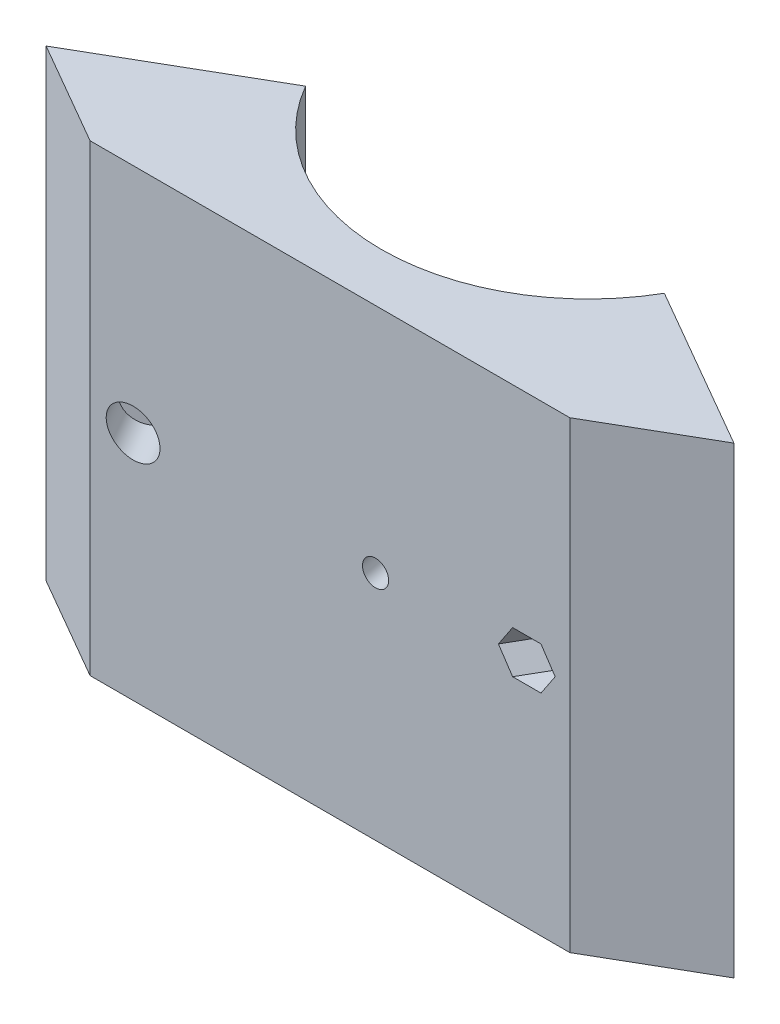
ISO-10303-21;
HEADER;
FILE_DESCRIPTION(('STEP AP214'),'2;1');
FILE_NAME('part.step','',(''),(''),'','','');
FILE_SCHEMA(('AUTOMOTIVE_DESIGN { 1 0 10303 214 1 1 1 1 }'));
ENDSEC;
DATA;
#1=APPLICATION_CONTEXT('core data for automotive mechanical design processes');
#2=APPLICATION_PROTOCOL_DEFINITION('international standard','automotive_design',2000,#1);
#3=PRODUCT_CONTEXT('',#1,'mechanical');
#4=PRODUCT('Part','Part','',(#3));
#5=PRODUCT_RELATED_PRODUCT_CATEGORY('part','',(#4));
#6=PRODUCT_DEFINITION_FORMATION('','',#4);
#7=PRODUCT_DEFINITION_CONTEXT('part definition',#1,'design');
#8=PRODUCT_DEFINITION('design','',#6,#7);
#9=PRODUCT_DEFINITION_SHAPE('','',#8);
#10=(LENGTH_UNIT() NAMED_UNIT(*) SI_UNIT(.MILLI.,.METRE.));
#11=(NAMED_UNIT(*) PLANE_ANGLE_UNIT() SI_UNIT($,.RADIAN.));
#12=(NAMED_UNIT(*) SI_UNIT($,.STERADIAN.) SOLID_ANGLE_UNIT());
#13=UNCERTAINTY_MEASURE_WITH_UNIT(LENGTH_MEASURE(1.E-05),#10,'distance_accuracy_value','');
#14=(GEOMETRIC_REPRESENTATION_CONTEXT(3) GLOBAL_UNCERTAINTY_ASSIGNED_CONTEXT((#13)) GLOBAL_UNIT_ASSIGNED_CONTEXT((#10,
#11,#12)) REPRESENTATION_CONTEXT('',''));
#15=CARTESIAN_POINT('',(0.,0.,0.));
#16=DIRECTION('',(0.,0.,1.));
#17=DIRECTION('',(1.,0.,0.));
#18=AXIS2_PLACEMENT_3D('',#15,#16,#17);
#19=CARTESIAN_POINT('',(0.,57.15,0.));
#20=DIRECTION('',(0.,-1.,0.));
#21=DIRECTION('',(0.,0.,-1.));
#22=AXIS2_PLACEMENT_3D('',#19,#20,#21);
#23=CYLINDRICAL_SURFACE('',#22,51.1048);
#24=CARTESIAN_POINT('',(10.2006124388606,0.,50.0764224851592));
#25=CARTESIAN_POINT('',(10.2006091830041,-0.075602569281534,50.0764233026099));
#26=CARTESIAN_POINT('',(10.1943489344255,-0.151259623694394,50.0776996310132));
#27=CARTESIAN_POINT('',(10.1694605419281,-0.300489132261792,50.082759612194));
#28=CARTESIAN_POINT('',(10.1508175985443,-0.374058982002331,50.0865462652339));
#29=CARTESIAN_POINT('',(10.1016885292384,-0.51693058682616,50.0964778841072));
#30=CARTESIAN_POINT('',(10.0712081657313,-0.586234399613679,50.1026217024632));
#31=CARTESIAN_POINT('',(9.99926660910638,-0.71862071361065,50.1170289379006));
#32=CARTESIAN_POINT('',(9.95780810796005,-0.781704734790663,50.1252918353427));
#33=CARTESIAN_POINT('',(9.86505441765735,-0.899904494519196,50.1436288402405));
#34=CARTESIAN_POINT('',(9.81375607115996,-0.955017665453727,50.1537035289861));
#35=CARTESIAN_POINT('',(9.70276925383221,-1.05568976473709,50.1752931340129));
#36=CARTESIAN_POINT('',(9.64308045010437,-1.10124831382057,50.1868081074364));
#37=CARTESIAN_POINT('',(9.51698485008781,-1.18152084928787,50.2108722933121));
#38=CARTESIAN_POINT('',(9.45057720339331,-1.21623346061956,50.2234216366475));
#39=CARTESIAN_POINT('',(9.31292298589816,-1.27381973611686,50.2491288077779));
#40=CARTESIAN_POINT('',(9.24167643228135,-1.29669344232211,50.2622866334122));
#41=CARTESIAN_POINT('',(9.09637589607956,-1.32994754024713,50.2887858072335));
#42=CARTESIAN_POINT('',(9.02232257235435,-1.34033084545053,50.302127111888));
#43=CARTESIAN_POINT('',(8.87349203627211,-1.34831836629202,50.3285945970101));
#44=CARTESIAN_POINT('',(8.7987148264413,-1.34592262651039,50.3417207782281));
#45=CARTESIAN_POINT('',(8.65057956306214,-1.32842254329805,50.3673873375127));
#46=CARTESIAN_POINT('',(8.577221162273,-1.31332135072872,50.3799278600047));
#47=CARTESIAN_POINT('',(8.43399189780083,-1.27084390018125,50.4041034266305));
#48=CARTESIAN_POINT('',(8.36412104087299,-1.24346761842789,50.4157384690106));
#49=CARTESIAN_POINT('',(8.22985023153958,-1.17721349094328,50.4378308757171));
#50=CARTESIAN_POINT('',(8.16545096758291,-1.13833420062638,50.4482880919005));
#51=CARTESIAN_POINT('',(8.04397205161109,-1.05017878427657,50.4678005042583));
#52=CARTESIAN_POINT('',(7.98689241181644,-1.00090264088593,50.4768556980921));
#53=CARTESIAN_POINT('',(7.88166949486915,-0.893334447962307,50.493392767375));
#54=CARTESIAN_POINT('',(7.83352893865441,-0.835039663140836,50.5008741638731));
#55=CARTESIAN_POINT('',(7.7475863165083,-0.711098625952373,50.5141305610248));
#56=CARTESIAN_POINT('',(7.70978425218379,-0.645452372442795,50.5199055614134));
#57=CARTESIAN_POINT('',(7.64560488995379,-0.508670334794139,50.5296582993654));
#58=CARTESIAN_POINT('',(7.61922767858163,-0.43753450908113,50.5336360233161));
#59=CARTESIAN_POINT('',(7.57865828247695,-0.291793329801561,50.5397363082867));
#60=CARTESIAN_POINT('',(7.56446607201508,-0.217187983561451,50.5418588732239));
#61=CARTESIAN_POINT('',(7.54867839796,-0.0666495845642801,50.5442192799461));
#62=CARTESIAN_POINT('',(7.54707914904077,0.00928306233996483,50.544457688091));
#63=CARTESIAN_POINT('',(7.55651356347958,0.160341694082065,50.5430480648116));
#64=CARTESIAN_POINT('',(7.56754721568459,0.235467679632026,50.5414000350527));
#65=CARTESIAN_POINT('',(7.60192678410511,0.382769749458086,50.5362403743405));
#66=CARTESIAN_POINT('',(7.62527098234903,0.454946243830068,50.5327290034213));
#67=CARTESIAN_POINT('',(7.68359848499465,0.594313069844253,50.523892985438));
#68=CARTESIAN_POINT('',(7.71858180711688,0.661503393894843,50.5185683356131));
#69=CARTESIAN_POINT('',(7.79919204306278,0.789008202281439,50.5061861896603));
#70=CARTESIAN_POINT('',(7.84482150106084,0.849321037923399,50.4991282793029));
#71=CARTESIAN_POINT('',(7.94541069754585,0.961342244324108,50.4833994137529));
#72=CARTESIAN_POINT('',(8.00037045525215,1.01305059735816,50.4747284552375));
#73=CARTESIAN_POINT('',(8.11806153843076,1.10640776855146,50.4559332993647));
#74=CARTESIAN_POINT('',(8.18079476458152,1.14805411909468,50.4458087464948));
#75=CARTESIAN_POINT('',(8.31222862107608,1.22008820822467,50.4243182077334));
#76=CARTESIAN_POINT('',(8.38092923960745,1.25047596909713,50.4129522242993));
#77=CARTESIAN_POINT('',(8.52232766035307,1.29912596076465,50.3892413943672));
#78=CARTESIAN_POINT('',(8.59502493314111,1.31738979341364,50.3768966774242));
#79=CARTESIAN_POINT('',(8.74235378146458,1.34127874227564,50.3515383916593));
#80=CARTESIAN_POINT('',(8.81698535649285,1.34690386180243,50.3385248230129));
#81=CARTESIAN_POINT('',(8.96603772330667,1.34535551181085,50.3121901386988));
#82=CARTESIAN_POINT('',(9.04045857231804,1.33818593601431,50.2988691178135));
#83=CARTESIAN_POINT('',(9.1870025546818,1.31125970868799,50.2723096215448));
#84=CARTESIAN_POINT('',(9.2591256834659,1.29150303213436,50.2590711463255));
#85=CARTESIAN_POINT('',(9.39903608561466,1.23996384909115,50.2330943769578));
#86=CARTESIAN_POINT('',(9.46682328371729,1.20818113392265,50.220356091493));
#87=CARTESIAN_POINT('',(9.59614693678848,1.13349372733718,50.1958054490419));
#88=CARTESIAN_POINT('',(9.65768362212694,1.0905894460256,50.1839930579342));
#89=CARTESIAN_POINT('',(9.77279009072699,0.994866546269899,50.1617045252551));
#90=CARTESIAN_POINT('',(9.82635829521354,0.942045967811669,50.1512286485422));
#91=CARTESIAN_POINT('',(9.92402145798969,0.827977120983066,50.1319944337289));
#92=CARTESIAN_POINT('',(9.96811406525438,0.76672676724007,50.1232365219258));
#93=CARTESIAN_POINT('',(10.0455943581778,0.637516134956807,50.1077657044754));
#94=CARTESIAN_POINT('',(10.0789755075231,0.569551792379986,50.1010540476116));
#95=CARTESIAN_POINT('',(10.1340290276473,0.428923408382122,50.0899474437902));
#96=CARTESIAN_POINT('',(10.155715377895,0.356265094852001,50.0855497309952));
#97=CARTESIAN_POINT('',(10.1810175856099,0.235955724128457,50.0804108963139));
#98=CARTESIAN_POINT('',(10.1883565320773,0.189085768117223,50.0789177163125));
#99=CARTESIAN_POINT('',(10.1981549792226,0.0948176862660237,50.076923254486));
#100=CARTESIAN_POINT('',(10.2006144810041,0.0474195605455112,50.0764219724366));
#101=CARTESIAN_POINT('',(10.2006124388606,0.,50.0764224851592));
#102=B_SPLINE_CURVE_WITH_KNOTS('',3,(#24,#25,#26,#27,#28,#29,#30,#31,#32,#33,#34,#35,#36,#37,
#38,#39,#40,#41,#42,#43,#44,#45,#46,#47,#48,#49,#50,#51,#52,#53,#54,#55,#56,#57,#58,#59,#60,#61,
#62,#63,#64,#65,#66,#67,#68,#69,#70,#71,#72,#73,#74,#75,#76,#77,#78,#79,#80,#81,#82,#83,#84,#85,
#86,#87,#88,#89,#90,#91,#92,#93,#94,#95,#96,#97,#98,#99,#100,#101),.UNSPECIFIED.,.T.,.F.,(4,2,2,
2,2,2,2,2,2,2,2,2,2,2,2,2,2,2,2,2,2,2,2,2,2,2,2,2,2,2,2,2,2,2,2,2,2,2,4),(0.,0.226634621685728,
0.453540599571558,0.680336258592575,0.907076356005871,1.13388933027699,1.36071130605859,
1.58756202675958,1.81441194191404,2.0412089322864,2.26800513146781,2.49474510338691,
2.72148551447312,2.94825441246116,3.175023689047,3.40186187843176,3.62870010307241,
3.85554004578543,4.08237950951126,4.30915078481988,4.5359218599223,4.76266129684976,
4.98940107898863,5.21619510216681,5.44298959252065,5.66983964586493,5.89668925017112,
6.12350887638058,6.35032844311968,6.57707899518696,6.80382999804807,7.03058493573154,
7.25733151306419,7.48412295545986,7.71097060310515,7.93795641494888,8.16467029270133,
8.30682044311775,8.44897056138575),.UNSPECIFIED.);
#103=CARTESIAN_POINT('',(10.2006124388606,0.,50.0764224851592));
#104=VERTEX_POINT('',#103);
#105=EDGE_CURVE('E55',#104,#104,#102,.T.);
#106=ORIENTED_EDGE('',*,*,#105,.F.);
#107=EDGE_LOOP('',(#106));
#108=FACE_BOUND('',#107,.T.);
#109=CARTESIAN_POINT('',(0.,-57.15,0.));
#110=DIRECTION('',(0.,1.,0.));
#111=DIRECTION('',(0.,0.,1.));
#112=AXIS2_PLACEMENT_3D('',#109,#110,#111);
#113=CIRCLE('',#112,51.1048);
#114=CARTESIAN_POINT('',(-44.258055055323,-57.15,25.5524));
#115=VERTEX_POINT('',#114);
#116=CARTESIAN_POINT('',(44.258055055323,-57.15,25.5524));
#117=VERTEX_POINT('',#116);
#118=EDGE_CURVE('E151',#115,#117,#113,.T.);
#119=ORIENTED_EDGE('',*,*,#118,.F.);
#120=DIRECTION('',(0.,-1.,0.));
#121=VECTOR('',#120,1.);
#122=CARTESIAN_POINT('',(-44.258055055323,57.15,25.5524));
#123=LINE('',#122,#121);
#124=CARTESIAN_POINT('',(-44.258055055323,57.15,25.5524));
#125=VERTEX_POINT('',#124);
#126=EDGE_CURVE('E112',#125,#115,#123,.T.);
#127=ORIENTED_EDGE('',*,*,#126,.F.);
#128=CARTESIAN_POINT('',(0.,57.15,0.));
#129=DIRECTION('',(0.,1.,0.));
#130=DIRECTION('',(0.,0.,1.));
#131=AXIS2_PLACEMENT_3D('',#128,#129,#130);
#132=CIRCLE('',#131,51.1048);
#133=CARTESIAN_POINT('',(44.258055055323,57.15,25.5524));
#134=VERTEX_POINT('',#133);
#135=EDGE_CURVE('E164',#125,#134,#132,.T.);
#136=ORIENTED_EDGE('',*,*,#135,.T.);
#137=DIRECTION('',(0.,-1.,0.));
#138=VECTOR('',#137,1.);
#139=CARTESIAN_POINT('',(44.258055055323,57.15,25.5524));
#140=LINE('',#139,#138);
#141=EDGE_CURVE('E107',#134,#117,#140,.T.);
#142=ORIENTED_EDGE('',*,*,#141,.T.);
#143=EDGE_LOOP('',(#119,#127,#136,#142));
#144=FACE_BOUND('',#143,.T.);
#145=ADVANCED_FACE('F51',(#108,#144),#23,.F.);
#146=CARTESIAN_POINT('',(0.,57.15,0.));
#147=DIRECTION('',(0.5,0.,0.866025403784439));
#148=DIRECTION('',(0.866025403784439,0.,-0.5));
#149=AXIS2_PLACEMENT_3D('',#146,#147,#148);
#150=PLANE('',#149);
#151=CARTESIAN_POINT('',(-64.0553957858352,0.,36.9824));
#152=DIRECTION('',(-0.5,0.,-0.866025403784439));
#153=DIRECTION('',(-0.866025403784439,0.,0.5));
#154=AXIS2_PLACEMENT_3D('',#151,#152,#153);
#155=CIRCLE('',#154,3.49999998500002);
#156=CARTESIAN_POINT('',(-67.0864846860904,0.,38.7323999925));
#157=VERTEX_POINT('',#156);
#158=EDGE_CURVE('E155',#157,#157,#155,.T.);
#159=ORIENTED_EDGE('',*,*,#158,.F.);
#160=EDGE_LOOP('',(#159));
#161=FACE_BOUND('',#160,.T.);
#162=DIRECTION('',(-0.866025403784439,0.,0.5));
#163=VECTOR('',#162,1.);
#164=CARTESIAN_POINT('',(0.,-57.15,0.));
#165=LINE('',#164,#163);
#166=CARTESIAN_POINT('',(-84.8499359012918,-57.15,48.9881333333333));
#167=VERTEX_POINT('',#166);
#168=EDGE_CURVE('E154',#115,#167,#165,.T.);
#169=ORIENTED_EDGE('',*,*,#168,.T.);
#170=DIRECTION('',(0.,-1.,0.));
#171=VECTOR('',#170,1.);
#172=CARTESIAN_POINT('',(-84.8499359012918,57.15,48.9881333333333));
#173=LINE('',#172,#171);
#174=CARTESIAN_POINT('',(-84.8499359012918,57.15,48.9881333333333));
#175=VERTEX_POINT('',#174);
#176=EDGE_CURVE('E168',#175,#167,#173,.T.);
#177=ORIENTED_EDGE('',*,*,#176,.F.);
#178=DIRECTION('',(-0.866025403784439,0.,0.5));
#179=VECTOR('',#178,1.);
#180=CARTESIAN_POINT('',(0.,57.15,0.));
#181=LINE('',#180,#179);
#182=EDGE_CURVE('E240',#125,#175,#181,.T.);
#183=ORIENTED_EDGE('',*,*,#182,.F.);
#184=ORIENTED_EDGE('',*,*,#126,.T.);
#185=EDGE_LOOP('',(#169,#177,#183,#184));
#186=FACE_BOUND('',#185,.T.);
#187=ADVANCED_FACE('F243',(#161,#186),#150,.F.);
#188=CARTESIAN_POINT('',(-42.4249679506459,57.15,73.4822));
#189=DIRECTION('',(0.5,0.,-0.866025403784439));
#190=DIRECTION('',(-0.866025403784439,0.,-0.5));
#191=AXIS2_PLACEMENT_3D('',#188,#189,#190);
#192=PLANE('',#191);
#193=DIRECTION('',(0.866025403784439,0.,0.5));
#194=VECTOR('',#193,1.);
#195=CARTESIAN_POINT('',(-42.4249679506459,-57.15,73.4822));
#196=LINE('',#195,#194);
#197=CARTESIAN_POINT('',(-59.186716435813,-57.15,63.8048));
#198=VERTEX_POINT('',#197);
#199=EDGE_CURVE('E157',#167,#198,#196,.T.);
#200=ORIENTED_EDGE('',*,*,#199,.T.);
#201=DIRECTION('',(0.,-1.,0.));
#202=VECTOR('',#201,1.);
#203=CARTESIAN_POINT('',(-59.186716435813,57.15,63.8048));
#204=LINE('',#203,#202);
#205=CARTESIAN_POINT('',(-59.186716435813,57.15,63.8048));
#206=VERTEX_POINT('',#205);
#207=EDGE_CURVE('E142',#206,#198,#204,.T.);
#208=ORIENTED_EDGE('',*,*,#207,.F.);
#209=DIRECTION('',(0.866025403784439,0.,0.5));
#210=VECTOR('',#209,1.);
#211=CARTESIAN_POINT('',(-42.4249679506459,57.15,73.4822));
#212=LINE('',#211,#210);
#213=EDGE_CURVE('E130',#175,#206,#212,.T.);
#214=ORIENTED_EDGE('',*,*,#213,.F.);
#215=ORIENTED_EDGE('',*,*,#176,.T.);
#216=EDGE_LOOP('',(#200,#208,#214,#215));
#217=FACE_BOUND('',#216,.T.);
#218=ADVANCED_FACE('F247',(#217),#192,.F.);
#219=CARTESIAN_POINT('',(0.,57.15,63.8048));
#220=DIRECTION('',(0.,0.,-1.));
#221=DIRECTION('',(-1.,0.,0.));
#222=AXIS2_PLACEMENT_3D('',#219,#220,#221);
#223=PLANE('',#222);
#224=CARTESIAN_POINT('',(11.2553533201039,0.,63.8048));
#225=DIRECTION('',(0.,0.,-1.));
#226=DIRECTION('',(1.,0.,0.));
#227=AXIS2_PLACEMENT_3D('',#224,#225,#226);
#228=ELLIPSE('',#227,3.22402137182331,3.175);
#229=CARTESIAN_POINT('',(14.4793746919272,0.,63.8048));
#230=VERTEX_POINT('',#229);
#231=EDGE_CURVE('E268',#230,#230,#228,.F.);
#232=ORIENTED_EDGE('',*,*,#231,.F.);
#233=EDGE_LOOP('',(#232));
#234=FACE_BOUND('',#233,.T.);
#235=DIRECTION('',(0.554700196225229,0.832050294337844,0.));
#236=VECTOR('',#235,1.);
#237=CARTESIAN_POINT('',(55.1557909875162,20.3794726749892,63.8048));
#238=LINE('',#237,#236);
#239=CARTESIAN_POINT('',(41.5694758708568,0.,63.8048));
#240=VERTEX_POINT('',#239);
#241=CARTESIAN_POINT('',(45.0694758981901,5.250000041,63.8048));
#242=VERTEX_POINT('',#241);
#243=EDGE_CURVE('E64',#240,#242,#238,.T.);
#244=ORIENTED_EDGE('',*,*,#243,.T.);
#245=DIRECTION('',(1.,0.,0.));
#246=VECTOR('',#245,1.);
#247=CARTESIAN_POINT('',(0.,5.250000041,63.8048));
#248=LINE('',#247,#246);
#249=CARTESIAN_POINT('',(52.0694759528567,5.25000004099999,63.8048));
#250=VERTEX_POINT('',#249);
#251=EDGE_CURVE('E12',#242,#250,#248,.T.);
#252=ORIENTED_EDGE('',*,*,#251,.T.);
#253=DIRECTION('',(0.55470019622523,-0.832050294337843,0.));
#254=VECTOR('',#253,1.);
#255=CARTESIAN_POINT('',(12.09425260167,65.21283506778,63.8048));
#256=LINE('',#255,#254);
#257=CARTESIAN_POINT('',(55.5694759801901,0.,63.8048));
#258=VERTEX_POINT('',#257);
#259=EDGE_CURVE('E172',#250,#258,#256,.T.);
#260=ORIENTED_EDGE('',*,*,#259,.T.);
#261=DIRECTION('',(-0.554700196225229,-0.832050294337844,0.));
#262=VECTOR('',#261,1.);
#263=CARTESIAN_POINT('',(64.8480987555162,13.9179341629892,63.8048));
#264=LINE('',#263,#262);
#265=CARTESIAN_POINT('',(52.0694759528567,-5.250000041,63.8048));
#266=VERTEX_POINT('',#265);
#267=EDGE_CURVE('E179',#258,#266,#264,.T.);
#268=ORIENTED_EDGE('',*,*,#267,.T.);
#269=DIRECTION('',(-1.,0.,0.));
#270=VECTOR('',#269,1.);
#271=CARTESIAN_POINT('',(0.,-5.250000041,63.8048));
#272=LINE('',#271,#270);
#273=CARTESIAN_POINT('',(45.0694758981901,-5.250000041,63.8048));
#274=VERTEX_POINT('',#273);
#275=EDGE_CURVE('E182',#266,#274,#272,.T.);
#276=ORIENTED_EDGE('',*,*,#275,.T.);
#277=DIRECTION('',(-0.554700196225229,0.832050294337844,0.));
#278=VECTOR('',#277,1.);
#279=CARTESIAN_POINT('',(2.40194483367008,58.7512965557801,63.8048));
#280=LINE('',#279,#278);
#281=EDGE_CURVE('E185',#274,#240,#280,.T.);
#282=ORIENTED_EDGE('',*,*,#281,.T.);
#283=EDGE_LOOP('',(#244,#252,#260,#268,#276,#282));
#284=FACE_BOUND('',#283,.T.);
#285=CARTESIAN_POINT('',(-48.5694759255234,0.,63.8048));
#286=DIRECTION('',(0.,0.,-1.));
#287=DIRECTION('',(-1.,0.,0.));
#288=AXIS2_PLACEMENT_3D('',#285,#286,#287);
#289=ELLIPSE('',#288,6.63952816149863,5.75000005700001);
#290=CARTESIAN_POINT('',(-55.2090040870221,0.,63.8048));
#291=VERTEX_POINT('',#290);
#292=EDGE_CURVE('E173',#291,#291,#289,.T.);
#293=ORIENTED_EDGE('',*,*,#292,.T.);
#294=EDGE_LOOP('',(#293));
#295=FACE_BOUND('',#294,.T.);
#296=DIRECTION('',(1.,0.,0.));
#297=VECTOR('',#296,1.);
#298=CARTESIAN_POINT('',(0.,-57.15,63.8048));
#299=LINE('',#298,#297);
#300=CARTESIAN_POINT('',(59.186716435813,-57.15,63.8048));
#301=VERTEX_POINT('',#300);
#302=EDGE_CURVE('E139',#198,#301,#299,.T.);
#303=ORIENTED_EDGE('',*,*,#302,.T.);
#304=DIRECTION('',(0.,-1.,0.));
#305=VECTOR('',#304,1.);
#306=CARTESIAN_POINT('',(59.186716435813,57.15,63.8048));
#307=LINE('',#306,#305);
#308=CARTESIAN_POINT('',(59.186716435813,57.15,63.8048));
#309=VERTEX_POINT('',#308);
#310=EDGE_CURVE('E136',#309,#301,#307,.T.);
#311=ORIENTED_EDGE('',*,*,#310,.F.);
#312=DIRECTION('',(1.,0.,0.));
#313=VECTOR('',#312,1.);
#314=CARTESIAN_POINT('',(0.,57.15,63.8048));
#315=LINE('',#314,#313);
#316=EDGE_CURVE('E123',#206,#309,#315,.T.);
#317=ORIENTED_EDGE('',*,*,#316,.F.);
#318=ORIENTED_EDGE('',*,*,#207,.T.);
#319=EDGE_LOOP('',(#303,#311,#317,#318));
#320=FACE_BOUND('',#319,.T.);
#321=ADVANCED_FACE('F137',(#234,#284,#295,#320),#223,.F.);
#322=CARTESIAN_POINT('',(42.4249679506458,57.15,73.4822));
#323=DIRECTION('',(-0.499999999999999,0.,-0.866025403784439));
#324=DIRECTION('',(-0.866025403784439,0.,0.499999999999999));
#325=AXIS2_PLACEMENT_3D('',#322,#323,#324);
#326=PLANE('',#325);
#327=DIRECTION('',(0.866025403784439,0.,-0.499999999999999));
#328=VECTOR('',#327,1.);
#329=CARTESIAN_POINT('',(42.4249679506458,-57.15,73.4822));
#330=LINE('',#329,#328);
#331=CARTESIAN_POINT('',(84.8499359012918,-57.15,48.9881333333334));
#332=VERTEX_POINT('',#331);
#333=EDGE_CURVE('E160',#301,#332,#330,.T.);
#334=ORIENTED_EDGE('',*,*,#333,.T.);
#335=DIRECTION('',(0.,-1.,0.));
#336=VECTOR('',#335,1.);
#337=CARTESIAN_POINT('',(84.8499359012918,57.15,48.9881333333334));
#338=LINE('',#337,#336);
#339=CARTESIAN_POINT('',(84.8499359012918,57.15,48.9881333333334));
#340=VERTEX_POINT('',#339);
#341=EDGE_CURVE('E143',#340,#332,#338,.T.);
#342=ORIENTED_EDGE('',*,*,#341,.F.);
#343=DIRECTION('',(0.866025403784439,0.,-0.499999999999999));
#344=VECTOR('',#343,1.);
#345=CARTESIAN_POINT('',(42.4249679506458,57.15,73.4822));
#346=LINE('',#345,#344);
#347=EDGE_CURVE('E127',#309,#340,#346,.T.);
#348=ORIENTED_EDGE('',*,*,#347,.F.);
#349=ORIENTED_EDGE('',*,*,#310,.T.);
#350=EDGE_LOOP('',(#334,#342,#348,#349));
#351=FACE_BOUND('',#350,.T.);
#352=ADVANCED_FACE('F145',(#351),#326,.F.);
#353=CARTESIAN_POINT('',(0.,57.15,0.));
#354=DIRECTION('',(-0.5,0.,0.866025403784439));
#355=DIRECTION('',(0.866025403784439,0.,0.5));
#356=AXIS2_PLACEMENT_3D('',#353,#354,#355);
#357=PLANE('',#356);
#358=CARTESIAN_POINT('',(64.0553957858352,0.,36.9824));
#359=DIRECTION('',(-0.5,0.,0.866025403784439));
#360=DIRECTION('',(0.866025403784439,0.,0.5));
#361=AXIS2_PLACEMENT_3D('',#358,#359,#360);
#362=CIRCLE('',#361,3.49999998500002);
#363=CARTESIAN_POINT('',(67.0864846860904,0.,38.7323999925));
#364=VERTEX_POINT('',#363);
#365=EDGE_CURVE('E217',#364,#364,#362,.T.);
#366=ORIENTED_EDGE('',*,*,#365,.T.);
#367=EDGE_LOOP('',(#366));
#368=FACE_BOUND('',#367,.T.);
#369=DIRECTION('',(-0.866025403784439,0.,-0.5));
#370=VECTOR('',#369,1.);
#371=CARTESIAN_POINT('',(0.,-57.15,0.));
#372=LINE('',#371,#370);
#373=EDGE_CURVE('E162',#332,#117,#372,.T.);
#374=ORIENTED_EDGE('',*,*,#373,.T.);
#375=ORIENTED_EDGE('',*,*,#141,.F.);
#376=DIRECTION('',(-0.866025403784439,0.,-0.5));
#377=VECTOR('',#376,1.);
#378=CARTESIAN_POINT('',(0.,57.15,0.));
#379=LINE('',#378,#377);
#380=EDGE_CURVE('E80',#340,#134,#379,.T.);
#381=ORIENTED_EDGE('',*,*,#380,.F.);
#382=ORIENTED_EDGE('',*,*,#341,.T.);
#383=EDGE_LOOP('',(#374,#375,#381,#382));
#384=FACE_BOUND('',#383,.T.);
#385=ADVANCED_FACE('F252',(#368,#384),#357,.F.);
#386=CARTESIAN_POINT('',(0.,57.15,0.));
#387=DIRECTION('',(0.,1.,0.));
#388=DIRECTION('',(0.,0.,1.));
#389=AXIS2_PLACEMENT_3D('',#386,#387,#388);
#390=PLANE('',#389);
#391=ORIENTED_EDGE('',*,*,#135,.F.);
#392=ORIENTED_EDGE('',*,*,#182,.T.);
#393=ORIENTED_EDGE('',*,*,#213,.T.);
#394=ORIENTED_EDGE('',*,*,#316,.T.);
#395=ORIENTED_EDGE('',*,*,#347,.T.);
#396=ORIENTED_EDGE('',*,*,#380,.T.);
#397=EDGE_LOOP('',(#391,#392,#393,#394,#395,#396));
#398=FACE_BOUND('',#397,.T.);
#399=ADVANCED_FACE('F125',(#398),#390,.T.);
#400=CARTESIAN_POINT('',(0.,-57.15,0.));
#401=DIRECTION('',(0.,1.,0.));
#402=DIRECTION('',(0.,0.,1.));
#403=AXIS2_PLACEMENT_3D('',#400,#401,#402);
#404=PLANE('',#403);
#405=ORIENTED_EDGE('',*,*,#118,.T.);
#406=ORIENTED_EDGE('',*,*,#373,.F.);
#407=ORIENTED_EDGE('',*,*,#333,.F.);
#408=ORIENTED_EDGE('',*,*,#302,.F.);
#409=ORIENTED_EDGE('',*,*,#199,.F.);
#410=ORIENTED_EDGE('',*,*,#168,.F.);
#411=EDGE_LOOP('',(#405,#406,#407,#408,#409,#410));
#412=FACE_BOUND('',#411,.T.);
#413=ADVANCED_FACE('F249',(#412),#404,.F.);
#414=CARTESIAN_POINT('',(-64.0553957858352,0.,36.9824));
#415=DIRECTION('',(-0.5,0.,-0.866025403784439));
#416=DIRECTION('',(-0.866025403784439,0.,0.5));
#417=AXIS2_PLACEMENT_3D('',#414,#415,#416);
#418=CYLINDRICAL_SURFACE('',#417,3.49999998500001);
#419=CARTESIAN_POINT('',(-54.0553958468352,0.,54.3029079700337));
#420=DIRECTION('',(-0.5,0.,-0.866025403784439));
#421=DIRECTION('',(-0.866025403784439,0.,0.5));
#422=AXIS2_PLACEMENT_3D('',#419,#420,#421);
#423=CIRCLE('',#422,3.49999998500003);
#424=CARTESIAN_POINT('',(-57.0864847470904,0.,56.0529079625337));
#425=VERTEX_POINT('',#424);
#426=EDGE_CURVE('E176',#425,#425,#423,.T.);
#427=ORIENTED_EDGE('',*,*,#426,.F.);
#428=EDGE_LOOP('',(#427));
#429=FACE_BOUND('',#428,.T.);
#430=ORIENTED_EDGE('',*,*,#158,.T.);
#431=EDGE_LOOP('',(#430));
#432=FACE_BOUND('',#431,.T.);
#433=ADVANCED_FACE('F335',(#429,#432),#418,.F.);
#434=CARTESIAN_POINT('',(-64.0553957858352,0.,36.9824));
#435=DIRECTION('',(-0.5,0.,-0.866025403784439));
#436=DIRECTION('',(-0.866025403784439,0.,0.5));
#437=AXIS2_PLACEMENT_3D('',#434,#435,#436);
#438=CYLINDRICAL_SURFACE('',#437,5.75000005700001);
#439=CARTESIAN_POINT('',(-54.0553958468352,0.,54.3029079700337));
#440=DIRECTION('',(-0.5,0.,-0.866025403784439));
#441=DIRECTION('',(-0.866025403784439,0.,0.5));
#442=AXIS2_PLACEMENT_3D('',#439,#440,#441);
#443=CIRCLE('',#442,5.75000005700001);
#444=CARTESIAN_POINT('',(-59.0350419679592,0.,57.1779079985337));
#445=VERTEX_POINT('',#444);
#446=EDGE_CURVE('E232',#445,#445,#443,.T.);
#447=ORIENTED_EDGE('',*,*,#446,.T.);
#448=EDGE_LOOP('',(#447));
#449=FACE_BOUND('',#448,.T.);
#450=ORIENTED_EDGE('',*,*,#292,.F.);
#451=EDGE_LOOP('',(#450));
#452=FACE_BOUND('',#451,.T.);
#453=ADVANCED_FACE('F332',(#449,#452),#438,.F.);
#454=CARTESIAN_POINT('',(9.99999993900002,0.,17.3205079700337));
#455=DIRECTION('',(-0.5,0.,-0.866025403784439));
#456=DIRECTION('',(-0.866025403784439,0.,0.5));
#457=AXIS2_PLACEMENT_3D('',#454,#455,#456);
#458=PLANE('',#457);
#459=ORIENTED_EDGE('',*,*,#446,.F.);
#460=EDGE_LOOP('',(#459));
#461=FACE_BOUND('',#460,.T.);
#462=ORIENTED_EDGE('',*,*,#426,.T.);
#463=EDGE_LOOP('',(#462));
#464=FACE_BOUND('',#463,.T.);
#465=ADVANCED_FACE('F326',(#461,#464),#458,.F.);
#466=CARTESIAN_POINT('',(64.0553957858352,0.,36.9824));
#467=DIRECTION('',(0.5,0.,-0.866025403784439));
#468=DIRECTION('',(0.866025403784439,0.,0.5));
#469=AXIS2_PLACEMENT_3D('',#466,#467,#468);
#470=CYLINDRICAL_SURFACE('',#469,3.49999998500001);
#471=CARTESIAN_POINT('',(56.0553957838352,0.,50.8388064640151));
#472=DIRECTION('',(0.5,0.,-0.866025403784439));
#473=DIRECTION('',(-0.866025403784439,0.,-0.5));
#474=AXIS2_PLACEMENT_3D('',#471,#472,#473);
#475=CIRCLE('',#474,3.499999985);
#476=CARTESIAN_POINT('',(53.0243068835801,0.,49.0888064715151));
#477=VERTEX_POINT('',#476);
#478=EDGE_CURVE('E262',#477,#477,#475,.T.);
#479=ORIENTED_EDGE('',*,*,#478,.F.);
#480=EDGE_LOOP('',(#479));
#481=FACE_BOUND('',#480,.T.);
#482=ORIENTED_EDGE('',*,*,#365,.F.);
#483=EDGE_LOOP('',(#482));
#484=FACE_BOUND('',#483,.T.);
#485=ADVANCED_FACE('F319',(#481,#484),#470,.F.);
#486=CARTESIAN_POINT('',(12.5896229483196,5.250000041,120.061555531542));
#487=DIRECTION('',(0.,1.,0.));
#488=DIRECTION('',(0.,0.,1.));
#489=AXIS2_PLACEMENT_3D('',#486,#487,#488);
#490=PLANE('',#489);
#491=DIRECTION('',(0.5,0.,-0.866025403784439));
#492=VECTOR('',#491,1.);
#493=CARTESIAN_POINT('',(12.5896229483196,5.250000041,120.061555531542));
#494=LINE('',#493,#492);
#495=CARTESIAN_POINT('',(53.4303957633352,5.250000041,49.3232619955567));
#496=VERTEX_POINT('',#495);
#497=EDGE_CURVE('E206',#242,#496,#494,.T.);
#498=ORIENTED_EDGE('',*,*,#497,.T.);
#499=DIRECTION('',(0.866025403784439,0.,0.5));
#500=VECTOR('',#499,1.);
#501=CARTESIAN_POINT('',(53.4303957633352,5.250000041,49.3232619955567));
#502=LINE('',#501,#500);
#503=CARTESIAN_POINT('',(58.6803958043352,5.250000041,52.3543509324736));
#504=VERTEX_POINT('',#503);
#505=EDGE_CURVE('E265',#496,#504,#502,.T.);
#506=ORIENTED_EDGE('',*,*,#505,.T.);
#507=DIRECTION('',(0.5,0.,-0.866025403784439));
#508=VECTOR('',#507,1.);
#509=CARTESIAN_POINT('',(17.8396229893196,5.250000041,123.092644468458));
#510=LINE('',#509,#508);
#511=EDGE_CURVE('E226',#250,#504,#510,.T.);
#512=ORIENTED_EDGE('',*,*,#511,.F.);
#513=ORIENTED_EDGE('',*,*,#251,.F.);
#514=EDGE_LOOP('',(#498,#506,#512,#513));
#515=FACE_BOUND('',#514,.T.);
#516=ADVANCED_FACE('F314',(#515),#490,.F.);
#517=CARTESIAN_POINT('',(9.9646229278196,0.,118.546011063083));
#518=DIRECTION('',(-0.75,0.5,-0.433012701892219));
#519=DIRECTION('',(-0.554700196225229,-0.832050294337844,0.));
#520=AXIS2_PLACEMENT_3D('',#517,#518,#519);
#521=PLANE('',#520);
#522=DIRECTION('',(0.5,0.,-0.866025403784439));
#523=VECTOR('',#522,1.);
#524=CARTESIAN_POINT('',(9.9646229278196,0.,118.546011063083));
#525=LINE('',#524,#523);
#526=CARTESIAN_POINT('',(50.8053957428352,0.,47.8077175270982));
#527=VERTEX_POINT('',#526);
#528=EDGE_CURVE('E203',#240,#527,#525,.T.);
#529=ORIENTED_EDGE('',*,*,#528,.T.);
#530=DIRECTION('',(0.433012701892219,0.866025403784439,0.25));
#531=VECTOR('',#530,1.);
#532=CARTESIAN_POINT('',(50.8053957428352,0.,47.8077175270982));
#533=LINE('',#532,#531);
#534=EDGE_CURVE('E229',#527,#496,#533,.T.);
#535=ORIENTED_EDGE('',*,*,#534,.T.);
#536=ORIENTED_EDGE('',*,*,#497,.F.);
#537=ORIENTED_EDGE('',*,*,#243,.F.);
#538=EDGE_LOOP('',(#529,#535,#536,#537));
#539=FACE_BOUND('',#538,.T.);
#540=ADVANCED_FACE('F200',(#539),#521,.F.);
#541=CARTESIAN_POINT('',(12.5896229483196,-5.250000041,120.061555531542));
#542=DIRECTION('',(-0.75,-0.5,-0.433012701892219));
#543=DIRECTION('',(0.554700196225229,-0.832050294337844,0.));
#544=AXIS2_PLACEMENT_3D('',#541,#542,#543);
#545=PLANE('',#544);
#546=DIRECTION('',(0.5,0.,-0.866025403784439));
#547=VECTOR('',#546,1.);
#548=CARTESIAN_POINT('',(12.5896229483196,-5.250000041,120.061555531542));
#549=LINE('',#548,#547);
#550=CARTESIAN_POINT('',(53.4303957633352,-5.250000041,49.3232619955567));
#551=VERTEX_POINT('',#550);
#552=EDGE_CURVE('E215',#274,#551,#549,.T.);
#553=ORIENTED_EDGE('',*,*,#552,.T.);
#554=DIRECTION('',(-0.433012701892219,0.866025403784439,-0.25));
#555=VECTOR('',#554,1.);
#556=CARTESIAN_POINT('',(53.4303957633352,-5.250000041,49.3232619955567));
#557=LINE('',#556,#555);
#558=EDGE_CURVE('E213',#551,#527,#557,.T.);
#559=ORIENTED_EDGE('',*,*,#558,.T.);
#560=ORIENTED_EDGE('',*,*,#528,.F.);
#561=ORIENTED_EDGE('',*,*,#281,.F.);
#562=EDGE_LOOP('',(#553,#559,#560,#561));
#563=FACE_BOUND('',#562,.T.);
#564=ADVANCED_FACE('F210',(#563),#545,.F.);
#565=CARTESIAN_POINT('',(17.8396229893196,-5.250000041,123.092644468458));
#566=DIRECTION('',(0.,-1.,0.));
#567=DIRECTION('',(0.,0.,-1.));
#568=AXIS2_PLACEMENT_3D('',#565,#566,#567);
#569=PLANE('',#568);
#570=DIRECTION('',(0.5,0.,-0.866025403784439));
#571=VECTOR('',#570,1.);
#572=CARTESIAN_POINT('',(17.8396229893196,-5.250000041,123.092644468458));
#573=LINE('',#572,#571);
#574=CARTESIAN_POINT('',(58.6803958043352,-5.250000041,52.3543509324736));
#575=VERTEX_POINT('',#574);
#576=EDGE_CURVE('E219',#266,#575,#573,.T.);
#577=ORIENTED_EDGE('',*,*,#576,.T.);
#578=DIRECTION('',(-0.866025403784439,0.,-0.5));
#579=VECTOR('',#578,1.);
#580=CARTESIAN_POINT('',(58.6803958043352,-5.250000041,52.3543509324736));
#581=LINE('',#580,#579);
#582=EDGE_CURVE('E284',#575,#551,#581,.T.);
#583=ORIENTED_EDGE('',*,*,#582,.T.);
#584=ORIENTED_EDGE('',*,*,#552,.F.);
#585=ORIENTED_EDGE('',*,*,#275,.F.);
#586=EDGE_LOOP('',(#577,#583,#584,#585));
#587=FACE_BOUND('',#586,.T.);
#588=ADVANCED_FACE('F306',(#587),#569,.F.);
#589=CARTESIAN_POINT('',(20.4646230098196,0.,124.608188936917));
#590=DIRECTION('',(0.75,-0.5,0.43301270189222));
#591=DIRECTION('',(0.554700196225229,0.832050294337844,0.));
#592=AXIS2_PLACEMENT_3D('',#589,#590,#591);
#593=PLANE('',#592);
#594=DIRECTION('',(0.5,0.,-0.866025403784439));
#595=VECTOR('',#594,1.);
#596=CARTESIAN_POINT('',(20.4646230098196,0.,124.608188936917));
#597=LINE('',#596,#595);
#598=CARTESIAN_POINT('',(61.3053958248352,0.,53.869895400932));
#599=VERTEX_POINT('',#598);
#600=EDGE_CURVE('E71',#258,#599,#597,.T.);
#601=ORIENTED_EDGE('',*,*,#600,.T.);
#602=DIRECTION('',(-0.433012701892219,-0.866025403784439,-0.25));
#603=VECTOR('',#602,1.);
#604=CARTESIAN_POINT('',(61.3053958248352,0.,53.869895400932));
#605=LINE('',#604,#603);
#606=EDGE_CURVE('E281',#599,#575,#605,.T.);
#607=ORIENTED_EDGE('',*,*,#606,.T.);
#608=ORIENTED_EDGE('',*,*,#576,.F.);
#609=ORIENTED_EDGE('',*,*,#267,.F.);
#610=EDGE_LOOP('',(#601,#607,#608,#609));
#611=FACE_BOUND('',#610,.T.);
#612=ADVANCED_FACE('F308',(#611),#593,.F.);
#613=CARTESIAN_POINT('',(17.8396229893196,5.250000041,123.092644468458));
#614=DIRECTION('',(0.75,0.500000000000001,0.433012701892219));
#615=DIRECTION('',(-0.55470019622523,0.832050294337843,0.));
#616=AXIS2_PLACEMENT_3D('',#613,#614,#615);
#617=PLANE('',#616);
#618=ORIENTED_EDGE('',*,*,#511,.T.);
#619=DIRECTION('',(0.43301270189222,-0.866025403784438,0.25));
#620=VECTOR('',#619,1.);
#621=CARTESIAN_POINT('',(58.6803958043352,5.250000041,52.3543509324736));
#622=LINE('',#621,#620);
#623=EDGE_CURVE('E279',#504,#599,#622,.T.);
#624=ORIENTED_EDGE('',*,*,#623,.T.);
#625=ORIENTED_EDGE('',*,*,#600,.F.);
#626=ORIENTED_EDGE('',*,*,#259,.F.);
#627=EDGE_LOOP('',(#618,#624,#625,#626));
#628=FACE_BOUND('',#627,.T.);
#629=ADVANCED_FACE('F311',(#628),#617,.F.);
#630=CARTESIAN_POINT('',(-8.000000002,0.,13.8564064640151));
#631=DIRECTION('',(0.5,0.,-0.866025403784439));
#632=DIRECTION('',(-0.866025403784439,0.,-0.5));
#633=AXIS2_PLACEMENT_3D('',#630,#631,#632);
#634=PLANE('',#633);
#635=ORIENTED_EDGE('',*,*,#478,.T.);
#636=EDGE_LOOP('',(#635));
#637=FACE_BOUND('',#636,.T.);
#638=ORIENTED_EDGE('',*,*,#505,.F.);
#639=ORIENTED_EDGE('',*,*,#534,.F.);
#640=ORIENTED_EDGE('',*,*,#558,.F.);
#641=ORIENTED_EDGE('',*,*,#582,.F.);
#642=ORIENTED_EDGE('',*,*,#606,.F.);
#643=ORIENTED_EDGE('',*,*,#623,.F.);
#644=EDGE_LOOP('',(#638,#639,#640,#641,#642,#643));
#645=FACE_BOUND('',#644,.T.);
#646=ADVANCED_FACE('F291',(#637,#645),#634,.F.);
#647=CARTESIAN_POINT('',(0.,0.,0.));
#648=DIRECTION('',(0.17372071113733,0.,0.984794960650155));
#649=DIRECTION('',(0.984794960650155,0.,-0.17372071113733));
#650=AXIS2_PLACEMENT_3D('',#647,#648,#649);
#651=CYLINDRICAL_SURFACE('',#650,1.3462);
#652=ORIENTED_EDGE('',*,*,#105,.T.);
#653=EDGE_LOOP('',(#652));
#654=FACE_BOUND('',#653,.T.);
#655=CARTESIAN_POINT('',(9.42952545639205,0.,53.4544735050983));
#656=DIRECTION('',(0.17372071113733,0.,0.984794960650155));
#657=DIRECTION('',(0.984794960650155,0.,-0.17372071113733));
#658=AXIS2_PLACEMENT_3D('',#655,#656,#657);
#659=CIRCLE('',#658,1.3462);
#660=CARTESIAN_POINT('',(10.7552564324193,0.,53.2206106837652));
#661=VERTEX_POINT('',#660);
#662=EDGE_CURVE('E263',#661,#661,#659,.T.);
#663=ORIENTED_EDGE('',*,*,#662,.T.);
#664=EDGE_LOOP('',(#663));
#665=FACE_BOUND('',#664,.T.);
#666=ADVANCED_FACE('F453',(#654,#665),#651,.F.);
#667=CARTESIAN_POINT('',(9.25580474525492,0.,52.4696785444481));
#668=DIRECTION('',(0.17372071113733,0.,0.984794960650155));
#669=DIRECTION('',(0.984794960650155,0.,-0.17372071113733));
#670=AXIS2_PLACEMENT_3D('',#667,#668,#669);
#671=CYLINDRICAL_SURFACE('',#670,3.175);
#672=ORIENTED_EDGE('',*,*,#231,.T.);
#673=EDGE_LOOP('',(#672));
#674=FACE_BOUND('',#673,.T.);
#675=CARTESIAN_POINT('',(9.42952545639224,0.,53.4544735050982));
#676=DIRECTION('',(0.17372071113733,0.,0.984794960650155));
#677=DIRECTION('',(0.984794960650155,0.,-0.17372071113733));
#678=AXIS2_PLACEMENT_3D('',#675,#676,#677);
#679=CIRCLE('',#678,3.175);
#680=CARTESIAN_POINT('',(12.5562494564565,0.,52.9029102472372));
#681=VERTEX_POINT('',#680);
#682=EDGE_CURVE('E273',#681,#681,#679,.F.);
#683=ORIENTED_EDGE('',*,*,#682,.T.);
#684=EDGE_LOOP('',(#683));
#685=FACE_BOUND('',#684,.T.);
#686=ADVANCED_FACE('F469',(#674,#685),#671,.F.);
#687=CARTESIAN_POINT('',(9.42952545639205,0.,53.4544735050983));
#688=DIRECTION('',(0.17372071113733,0.,0.984794960650155));
#689=DIRECTION('',(0.984794960650155,0.,-0.17372071113733));
#690=AXIS2_PLACEMENT_3D('',#687,#688,#689);
#691=PLANE('',#690);
#692=ORIENTED_EDGE('',*,*,#662,.F.);
#693=EDGE_LOOP('',(#692));
#694=FACE_BOUND('',#693,.T.);
#695=ORIENTED_EDGE('',*,*,#682,.F.);
#696=EDGE_LOOP('',(#695));
#697=FACE_BOUND('',#696,.T.);
#698=ADVANCED_FACE('F478',(#694,#697),#691,.T.);
#699=CLOSED_SHELL('',(#145,#187,#218,#321,#352,#385,#399,#413,#433,#453,#465,#485,#516,#540,
#564,#588,#612,#629,#646,#666,#686,#698));
#700=MANIFOLD_SOLID_BREP('B2',#699);
#701=ADVANCED_BREP_SHAPE_REPRESENTATION('',(#18,#700),#14);
#702=SHAPE_DEFINITION_REPRESENTATION(#9,#701);
ENDSEC;
END-ISO-10303-21;
